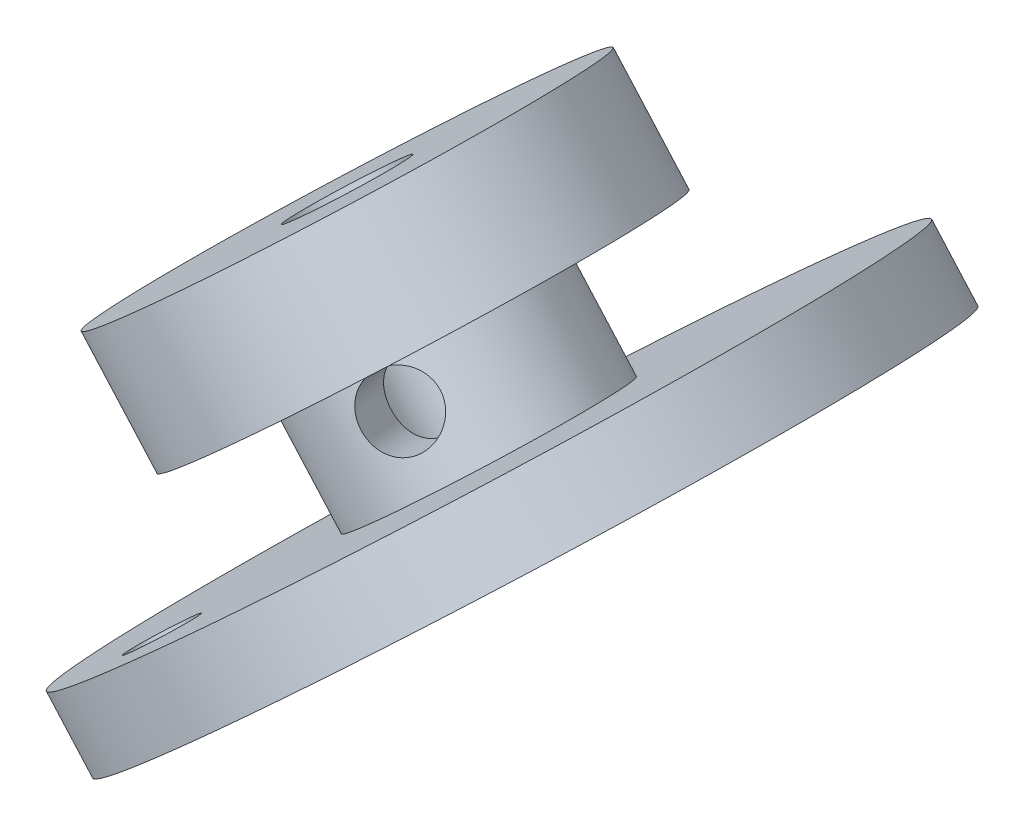
ISO-10303-21;
HEADER;
FILE_DESCRIPTION(('STEP AP214'),'2;1');
FILE_NAME('part.step','',(''),(''),'','','');
FILE_SCHEMA(('AUTOMOTIVE_DESIGN { 1 0 10303 214 1 1 1 1 }'));
ENDSEC;
DATA;
#1=APPLICATION_CONTEXT('core data for automotive mechanical design processes');
#2=APPLICATION_PROTOCOL_DEFINITION('international standard','automotive_design',2000,#1);
#3=PRODUCT_CONTEXT('',#1,'mechanical');
#4=PRODUCT('Part','Part','',(#3));
#5=PRODUCT_RELATED_PRODUCT_CATEGORY('part','',(#4));
#6=PRODUCT_DEFINITION_FORMATION('','',#4);
#7=PRODUCT_DEFINITION_CONTEXT('part definition',#1,'design');
#8=PRODUCT_DEFINITION('design','',#6,#7);
#9=PRODUCT_DEFINITION_SHAPE('','',#8);
#10=(LENGTH_UNIT() NAMED_UNIT(*) SI_UNIT(.MILLI.,.METRE.));
#11=(NAMED_UNIT(*) PLANE_ANGLE_UNIT() SI_UNIT($,.RADIAN.));
#12=(NAMED_UNIT(*) SI_UNIT($,.STERADIAN.) SOLID_ANGLE_UNIT());
#13=UNCERTAINTY_MEASURE_WITH_UNIT(LENGTH_MEASURE(1.E-05),#10,'distance_accuracy_value','');
#14=(GEOMETRIC_REPRESENTATION_CONTEXT(3) GLOBAL_UNCERTAINTY_ASSIGNED_CONTEXT((#13)) GLOBAL_UNIT_ASSIGNED_CONTEXT((#10,
#11,#12)) REPRESENTATION_CONTEXT('',''));
#15=CARTESIAN_POINT('',(0.,0.,0.));
#16=DIRECTION('',(0.,0.,1.));
#17=DIRECTION('',(1.,0.,0.));
#18=AXIS2_PLACEMENT_3D('',#15,#16,#17);
#19=CARTESIAN_POINT('',(70.9222588106821,-8.83401766160135,-35.8149463121795));
#20=DIRECTION('',(-0.664699798962186,0.747110552234159,0.));
#21=DIRECTION('',(-0.747110552234159,-0.664699798962186,0.));
#22=AXIS2_PLACEMENT_3D('',#19,#20,#21);
#23=PLANE('',#22);
#24=CARTESIAN_POINT('',(72.9575706573762,-7.02321285998626,-42.3844999999999));
#25=DIRECTION('',(-0.664699798962186,0.747110552234159,0.));
#26=DIRECTION('',(-0.747110552234159,-0.664699798962186,0.));
#27=AXIS2_PLACEMENT_3D('',#24,#25,#26);
#28=CIRCLE('',#27,7.112);
#29=CARTESIAN_POINT('',(67.6441204098869,-11.7505578302053,-42.3844999999999));
#30=VERTEX_POINT('',#29);
#31=EDGE_CURVE('E17',#30,#30,#28,.F.);
#32=ORIENTED_EDGE('',*,*,#31,.F.);
#33=EDGE_LOOP('',(#32));
#34=FACE_BOUND('',#33,.T.);
#35=CARTESIAN_POINT('',(72.9575706573762,-7.02321285998626,-42.3844999999999));
#36=DIRECTION('',(-0.664699798962186,0.747110552234159,0.));
#37=DIRECTION('',(-0.747110552234159,-0.664699798962186,0.));
#38=AXIS2_PLACEMENT_3D('',#35,#36,#37);
#39=CIRCLE('',#38,12.827);
#40=CARTESIAN_POINT('',(63.3743836038686,-15.5493171812742,-42.3844999999999));
#41=VERTEX_POINT('',#40);
#42=EDGE_CURVE('E113',#41,#41,#39,.T.);
#43=ORIENTED_EDGE('',*,*,#42,.F.);
#44=EDGE_LOOP('',(#43));
#45=FACE_BOUND('',#44,.T.);
#46=ADVANCED_FACE('F14',(#34,#45),#23,.F.);
#47=CARTESIAN_POINT('',(68.3990594360934,-1.8995286927643,-42.3844999999999));
#48=DIRECTION('',(-0.664699798962186,0.747110552234159,0.));
#49=DIRECTION('',(-0.747110552234159,-0.664699798962186,0.));
#50=AXIS2_PLACEMENT_3D('',#47,#48,#49);
#51=CYLINDRICAL_SURFACE('',#50,7.112);
#52=ORIENTED_EDGE('',*,*,#31,.T.);
#53=EDGE_LOOP('',(#52));
#54=FACE_BOUND('',#53,.T.);
#55=CARTESIAN_POINT('',(76.0241172948497,-7.24780935635152,-35.6026560288344));
#56=CARTESIAN_POINT('',(75.9504708586883,-7.16502094183076,-35.602655761772));
#57=CARTESIAN_POINT('',(75.8835464759126,-7.07608454668511,-35.6055164268872));
#58=CARTESIAN_POINT('',(75.7650808582406,-6.88870017845056,-35.6170619082306));
#59=CARTESIAN_POINT('',(75.7135679107307,-6.79023514868241,-35.6257573403765));
#60=CARTESIAN_POINT('',(75.6271418746926,-6.58720022980893,-35.6492225800623));
#61=CARTESIAN_POINT('',(75.5921944558109,-6.48264347495349,-35.6639797057673));
#62=CARTESIAN_POINT('',(75.5390834669348,-6.27047138684827,-35.6999452632156));
#63=CARTESIAN_POINT('',(75.5209167433758,-6.16285663220252,-35.7211524818089));
#64=CARTESIAN_POINT('',(75.5009165804455,-5.9449053893381,-35.7710837477244));
#65=CARTESIAN_POINT('',(75.4995162196565,-5.83457024549286,-35.7999874593855));
#66=CARTESIAN_POINT('',(75.5136103358346,-5.61727533426086,-35.8654278420963));
#67=CARTESIAN_POINT('',(75.5291076839662,-5.51031614367509,-35.9019658094632));
#68=CARTESIAN_POINT('',(75.5765804979763,-5.30115959009438,-35.9835878763024));
#69=CARTESIAN_POINT('',(75.6088526306614,-5.19908535565039,-36.0288162729473));
#70=CARTESIAN_POINT('',(75.6888041411077,-5.00526764287189,-36.1271167197071));
#71=CARTESIAN_POINT('',(75.7364804513616,-4.91352211263415,-36.1801872070484));
#72=CARTESIAN_POINT('',(75.8442044210536,-4.74572191112271,-36.2918719827349));
#73=CARTESIAN_POINT('',(75.9039012832889,-4.66932357300294,-36.3503079815506));
#74=CARTESIAN_POINT('',(76.0345009094757,-4.53184728491261,-36.4724269037569));
#75=CARTESIAN_POINT('',(76.1054015650998,-4.47076645807934,-36.5361088388913));
#76=CARTESIAN_POINT('',(76.2541055422014,-4.36724603751666,-36.6648890647425));
#77=CARTESIAN_POINT('',(76.3316538739802,-4.32432384760556,-36.7298949524714));
#78=CARTESIAN_POINT('',(76.4932529188901,-4.25558444597134,-36.8608489648041));
#79=CARTESIAN_POINT('',(76.5773040612665,-4.22976836448655,-36.9267971513737));
#80=CARTESIAN_POINT('',(76.7508461841944,-4.19530951116481,-37.0579824556892));
#81=CARTESIAN_POINT('',(76.8403863668788,-4.18685647491406,-37.1232040505097));
#82=CARTESIAN_POINT('',(77.0221599912275,-4.18735961270125,-37.2497042755367));
#83=CARTESIAN_POINT('',(77.1143938507755,-4.19631850222233,-37.3109822891809));
#84=CARTESIAN_POINT('',(77.3029834776518,-4.23149767946023,-37.4291257946613));
#85=CARTESIAN_POINT('',(77.3993716478251,-4.25830298252526,-37.4857660350432));
#86=CARTESIAN_POINT('',(77.5912577663531,-4.32857803413807,-37.5895461336241));
#87=CARTESIAN_POINT('',(77.6867552904918,-4.37205534601962,-37.6366816651381));
#88=CARTESIAN_POINT('',(77.8756015694483,-4.47456330875114,-37.7193199619949));
#89=CARTESIAN_POINT('',(77.9689250340678,-4.53372351596034,-37.7547200283801));
#90=CARTESIAN_POINT('',(78.1501707614734,-4.6653824729675,-37.8111596007553));
#91=CARTESIAN_POINT('',(78.2381040526075,-4.73785268667696,-37.8322293841767));
#92=CARTESIAN_POINT('',(78.3573848929284,-4.84844285934239,-37.8510605013324));
#93=CARTESIAN_POINT('',(78.3919883261081,-4.88212550291915,-37.8552532798523));
#94=CARTESIAN_POINT('',(78.4596537301621,-4.95122710567418,-37.8608543803664));
#95=CARTESIAN_POINT('',(78.4927156939058,-4.98664607288265,-37.8622626894816));
#96=CARTESIAN_POINT('',(78.5985776991265,-5.10563851032189,-37.8622526638012));
#97=CARTESIAN_POINT('',(78.6677839680349,-5.19254472499541,-37.8548674765179));
#98=CARTESIAN_POINT('',(78.7951108646418,-5.3720452662529,-37.8257518577326));
#99=CARTESIAN_POINT('',(78.8532110376251,-5.46464968083525,-37.8039952796981));
#100=CARTESIAN_POINT('',(78.956301639674,-5.65285823479654,-37.7474875506186));
#101=CARTESIAN_POINT('',(79.001319105678,-5.74845572883352,-37.7127635427868));
#102=CARTESIAN_POINT('',(79.076916282136,-5.94062199006293,-37.6322123889181));
#103=CARTESIAN_POINT('',(79.1074987048121,-6.03719057131109,-37.5863873311246));
#104=CARTESIAN_POINT('',(79.1536758536644,-6.23185230604615,-37.4845523565181));
#105=CARTESIAN_POINT('',(79.1688639361842,-6.32992059616388,-37.4283103602143));
#106=CARTESIAN_POINT('',(79.1819109351952,-6.52306821921233,-37.3090545940014));
#107=CARTESIAN_POINT('',(79.1797669063137,-6.61814704136475,-37.2460396749151));
#108=CARTESIAN_POINT('',(79.1573569507689,-6.80500531936435,-37.1147229904977));
#109=CARTESIAN_POINT('',(79.1367597630576,-6.89669242495068,-37.0463455214305));
#110=CARTESIAN_POINT('',(79.0768954207796,-7.07263870410643,-36.9082162522028));
#111=CARTESIAN_POINT('',(79.0376319825789,-7.15689935229322,-36.838464728259));
#112=CARTESIAN_POINT('',(78.9423371634163,-7.313641412766,-36.7021354419221));
#113=CARTESIAN_POINT('',(78.8867643800688,-7.38637058251518,-36.6355222224803));
#114=CARTESIAN_POINT('',(78.7599299321514,-7.52049701397289,-36.5059377075336));
#115=CARTESIAN_POINT('',(78.6886712183671,-7.58189640301426,-36.4429657298597));
#116=CARTESIAN_POINT('',(78.5348860817536,-7.68993750086617,-36.3242604234014));
#117=CARTESIAN_POINT('',(78.4527396134303,-7.73695062541556,-36.2683717174764));
#118=CARTESIAN_POINT('',(78.2782455386014,-7.81716265820082,-36.16298596111));
#119=CARTESIAN_POINT('',(78.1858972585099,-7.85036065358672,-36.1134893331812));
#120=CARTESIAN_POINT('',(77.9928151411813,-7.90220412329633,-36.0210479155844));
#121=CARTESIAN_POINT('',(77.8920010604384,-7.92068747935797,-35.9781801976535));
#122=CARTESIAN_POINT('',(77.6859401809463,-7.94179256750591,-35.899836724501));
#123=CARTESIAN_POINT('',(77.580692693288,-7.94441182523883,-35.864362123231));
#124=CARTESIAN_POINT('',(77.3652069340472,-7.93316197642772,-35.7995482494859));
#125=CARTESIAN_POINT('',(77.2549217731452,-7.9187207430656,-35.7704629522367));
#126=CARTESIAN_POINT('',(77.0363323056915,-7.8722035016048,-35.7196302345286));
#127=CARTESIAN_POINT('',(76.9280289215796,-7.84011948690568,-35.6978861528769));
#128=CARTESIAN_POINT('',(76.7160447644558,-7.75819715627407,-35.6611256240605));
#129=CARTESIAN_POINT('',(76.6124113243356,-7.70820967272959,-35.6461681696168));
#130=CARTESIAN_POINT('',(76.4144616306718,-7.59141213479965,-35.6228492094173));
#131=CARTESIAN_POINT('',(76.3201260953699,-7.52463795951241,-35.6144737910859));
#132=CARTESIAN_POINT('',(76.1950969543534,-7.41916201566514,-35.6070404003779));
#133=CARTESIAN_POINT('',(76.159208453603,-7.38662268903548,-35.6053956529044));
#134=CARTESIAN_POINT('',(76.0898237778856,-7.31905071201701,-35.6032035229966));
#135=CARTESIAN_POINT('',(76.0563276139846,-7.28401805009661,-35.602656145638));
#136=CARTESIAN_POINT('',(76.0241172948497,-7.24780935635152,-35.6026560288344));
#137=B_SPLINE_CURVE_WITH_KNOTS('',3,(#55,#56,#57,#58,#59,#60,#61,#62,#63,#64,#65,#66,#67,#68,
#69,#70,#71,#72,#73,#74,#75,#76,#77,#78,#79,#80,#81,#82,#83,#84,#85,#86,#87,#88,#89,#90,#91,#92,
#93,#94,#95,#96,#97,#98,#99,#100,#101,#102,#103,#104,#105,#106,#107,#108,#109,#110,#111,#112,
#113,#114,#115,#116,#117,#118,#119,#120,#121,#122,#123,#124,#125,#126,#127,#128,#129,#130,#131,
#132,#133,#134,#135,#136),.UNSPECIFIED.,.T.,.F.,(4,2,2,2,2,2,2,2,2,2,2,2,2,2,2,2,2,2,2,2,2,2,2,
2,2,2,2,2,2,2,2,2,2,2,2,2,2,2,2,2,4),(0.,0.332227667044804,0.665061442126181,0.997202404728973,
1.32928093599779,1.66991915884053,2.01061527005121,2.35755269732793,2.70442107984189,
3.04234303810744,3.38020148185171,3.70841014031842,4.03664048209371,4.3684388979744,
4.70028906374852,5.04359125905306,5.3870493795839,5.73343835328494,6.07909317382578,
6.22439700987266,6.36970151798854,6.70192918503333,7.03476296011471,7.36690392271749,
7.6989824539863,8.03962067682904,8.38031678803971,8.72725421531644,9.0741225978304,
9.41204455609595,9.74990299984023,10.078111658307,10.4063420000823,10.7381404159629,
11.069990581737,11.4132927770416,11.7567508975724,12.1031398712734,12.4487946918143,
12.5940985278616,12.739403035978),.UNSPECIFIED.);
#138=CARTESIAN_POINT('',(76.0241172948497,-7.24780935635152,-35.6026560288344));
#139=VERTEX_POINT('',#138);
#140=EDGE_CURVE('E89',#139,#139,#137,.T.);
#141=ORIENTED_EDGE('',*,*,#140,.T.);
#142=EDGE_LOOP('',(#141));
#143=FACE_BOUND('',#142,.T.);
#144=CARTESIAN_POINT('',(76.9251637573815,-11.482715746272,-42.3844999999999));
#145=DIRECTION('',(-0.664699798962186,0.747110552234159,0.));
#146=DIRECTION('',(-0.747110552234159,-0.664699798962186,0.));
#147=AXIS2_PLACEMENT_3D('',#144,#145,#146);
#148=CIRCLE('',#147,7.112);
#149=CARTESIAN_POINT('',(71.6117135098922,-16.2100607164911,-42.3844999999999));
#150=VERTEX_POINT('',#149);
#151=EDGE_CURVE('E96',#150,#150,#148,.T.);
#152=ORIENTED_EDGE('',*,*,#151,.T.);
#153=EDGE_LOOP('',(#152));
#154=FACE_BOUND('',#153,.T.);
#155=ADVANCED_FACE('F97',(#54,#143,#154),#51,.T.);
#156=CARTESIAN_POINT('',(68.3990594360934,-1.8995286927643,-42.3844999999999));
#157=DIRECTION('',(-0.664699798962186,0.747110552234159,0.));
#158=DIRECTION('',(-0.747110552234159,-0.664699798962186,0.));
#159=AXIS2_PLACEMENT_3D('',#156,#157,#158);
#160=CYLINDRICAL_SURFACE('',#159,12.827);
#161=CARTESIAN_POINT('',(68.3990594360936,-1.89952869276451,-42.3844999999999));
#162=DIRECTION('',(-0.664699798962186,0.747110552234159,0.));
#163=DIRECTION('',(-0.747110552234159,-0.664699798962186,0.));
#164=AXIS2_PLACEMENT_3D('',#161,#162,#163);
#165=CIRCLE('',#164,12.827);
#166=CARTESIAN_POINT('',(58.8158723825861,-10.4256330140525,-42.3844999999999));
#167=VERTEX_POINT('',#166);
#168=EDGE_CURVE('E86',#167,#167,#165,.F.);
#169=ORIENTED_EDGE('',*,*,#168,.T.);
#170=EDGE_LOOP('',(#169));
#171=FACE_BOUND('',#170,.T.);
#172=ORIENTED_EDGE('',*,*,#42,.T.);
#173=EDGE_LOOP('',(#172));
#174=FACE_BOUND('',#173,.T.);
#175=ADVANCED_FACE('F101',(#171,#174),#160,.T.);
#176=CARTESIAN_POINT('',(70.8192282172992,-16.9151301511175,-22.6758389365389));
#177=DIRECTION('',(0.664699798962186,-0.747110552234159,0.));
#178=DIRECTION('',(0.747110552234159,0.664699798962186,0.));
#179=AXIS2_PLACEMENT_3D('',#176,#177,#178);
#180=PLANE('',#179);
#181=ORIENTED_EDGE('',*,*,#151,.F.);
#182=EDGE_LOOP('',(#181));
#183=FACE_BOUND('',#182,.T.);
#184=CARTESIAN_POINT('',(72.2730223935094,-15.6216981499637,-27.368377284982));
#185=DIRECTION('',(-0.664699798962186,0.747110552234159,0.));
#186=DIRECTION('',(-0.747110552234159,-0.664699798962186,0.));
#187=AXIS2_PLACEMENT_3D('',#184,#185,#186);
#188=CIRCLE('',#187,1.905);
#189=CARTESIAN_POINT('',(70.8497767915033,-16.8879512669866,-27.368377284982));
#190=VERTEX_POINT('',#189);
#191=EDGE_CURVE('E41',#190,#190,#188,.F.);
#192=ORIENTED_EDGE('',*,*,#191,.T.);
#193=EDGE_LOOP('',(#192));
#194=FACE_BOUND('',#193,.T.);
#195=CARTESIAN_POINT('',(76.9251637573815,-11.482715746272,-42.3844999999999));
#196=DIRECTION('',(-0.664699798962185,0.747110552234159,0.));
#197=DIRECTION('',(-0.747110552234159,-0.664699798962185,0.));
#198=AXIS2_PLACEMENT_3D('',#195,#196,#197);
#199=CIRCLE('',#198,21.336);
#200=CARTESIAN_POINT('',(60.9848130149135,-25.6647506569292,-42.3844999999999));
#201=VERTEX_POINT('',#200);
#202=EDGE_CURVE('E84',#201,#201,#199,.F.);
#203=ORIENTED_EDGE('',*,*,#202,.F.);
#204=EDGE_LOOP('',(#203));
#205=FACE_BOUND('',#204,.T.);
#206=ADVANCED_FACE('F68',(#183,#194,#205),#180,.F.);
#207=CARTESIAN_POINT('',(77.3968702241981,-6.02647926881111,-36.4898667612435));
#208=DIRECTION('',(0.418009632275076,0.37190067481528,0.828829195550685));
#209=DIRECTION('',(0.892872695969098,0.,-0.450309170229603));
#210=AXIS2_PLACEMENT_3D('',#207,#208,#209);
#211=CYLINDRICAL_SURFACE('',#210,2.0193);
#212=CARTESIAN_POINT('',(77.2844071876067,-7.47422662923737,-41.1683193993993));
#213=CARTESIAN_POINT('',(77.3326524652259,-7.56946963752706,-41.102581379712));
#214=CARTESIAN_POINT('',(77.3727193399558,-7.66394165079535,-41.0296225910241));
#215=CARTESIAN_POINT('',(77.4344621299075,-7.85141694130959,-40.8743612142622));
#216=CARTESIAN_POINT('',(77.4561040442718,-7.94441719370468,-40.7920416679564));
#217=CARTESIAN_POINT('',(77.4787249371517,-8.12878437893057,-40.6222363581434));
#218=CARTESIAN_POINT('',(77.4796474933948,-8.2201461750076,-40.5347371381691));
#219=CARTESIAN_POINT('',(77.4583559355074,-8.39960794216561,-40.3592508078017));
#220=CARTESIAN_POINT('',(77.4361752770536,-8.48771243907229,-40.271264585915));
#221=CARTESIAN_POINT('',(77.3699794194033,-8.65131839688389,-40.1065171808026));
#222=CARTESIAN_POINT('',(77.3278980852574,-8.72726130159182,-40.029426449655));
#223=CARTESIAN_POINT('',(77.2231193647374,-8.87170072986755,-39.8826586325297));
#224=CARTESIAN_POINT('',(77.1604439926317,-8.94020510136896,-39.812973734802));
#225=CARTESIAN_POINT('',(77.0269673959466,-9.05787021045445,-39.6934787022823));
#226=CARTESIAN_POINT('',(76.9586172143692,-9.10839616573109,-39.642251484116));
#227=CARTESIAN_POINT('',(76.8106749193975,-9.20050184346144,-39.548812322707));
#228=CARTESIAN_POINT('',(76.7310825429931,-9.24208135655663,-39.5066005904387));
#229=CARTESIAN_POINT('',(76.5643267389905,-9.31489039975643,-39.4319904578757));
#230=CARTESIAN_POINT('',(76.4772548384545,-9.34622734385775,-39.3994905413457));
#231=CARTESIAN_POINT('',(76.2974167619592,-9.39863818930176,-39.3432838563303));
#232=CARTESIAN_POINT('',(76.204649437935,-9.41971001373611,-39.3195788675252));
#233=CARTESIAN_POINT('',(76.0043415473207,-9.4531703238738,-39.2776798312612));
#234=CARTESIAN_POINT('',(75.8963667216639,-9.46420847660532,-39.2604924419031));
#235=CARTESIAN_POINT('',(75.678816665128,-9.47254248669661,-39.234285565974));
#236=CARTESIAN_POINT('',(75.5692394820082,-9.46981989298895,-39.2252770651381));
#237=CARTESIAN_POINT('',(75.3355238490008,-9.44841892856219,-39.2126097737195));
#238=CARTESIAN_POINT('',(75.2115290181908,-9.4275280824458,-39.2098931507534));
#239=CARTESIAN_POINT('',(74.9688526639319,-9.36487976398747,-39.2091872437042));
#240=CARTESIAN_POINT('',(74.8501656019232,-9.3231446233121,-39.2111929088911));
#241=CARTESIAN_POINT('',(74.6520993124425,-9.23023773538981,-39.2156526584976));
#242=CARTESIAN_POINT('',(74.5703550614756,-9.18409947949949,-39.2178661283991));
#243=CARTESIAN_POINT('',(74.4158866012366,-9.07883699662594,-39.2215075639144));
#244=CARTESIAN_POINT('',(74.3431320046429,-9.01975849994344,-39.2229382351409));
#245=CARTESIAN_POINT('',(74.249107952138,-8.92837979543183,-39.2238429047497));
#246=CARTESIAN_POINT('',(74.222919024554,-8.90100869063621,-39.2239743174725));
#247=CARTESIAN_POINT('',(74.1645571289583,-8.83540093697706,-39.2239717531226));
#248=CARTESIAN_POINT('',(74.133139380157,-8.79648294722896,-39.2237397727852));
#249=CARTESIAN_POINT('',(74.0741265157319,-8.71584355860212,-39.2228517601711));
#250=CARTESIAN_POINT('',(74.0465338386722,-8.67412039630388,-39.2221954588768));
#251=CARTESIAN_POINT('',(73.969590821713,-8.54518741660411,-39.2197422271598));
#252=CARTESIAN_POINT('',(73.9261998327895,-8.45435544304673,-39.2174616156437));
#253=CARTESIAN_POINT('',(73.8554612530412,-8.2677773384788,-39.2131624228209));
#254=CARTESIAN_POINT('',(73.8279714071878,-8.17208338495285,-39.2111416480175));
#255=CARTESIAN_POINT('',(73.787070424491,-7.97779426000278,-39.2091515970517));
#256=CARTESIAN_POINT('',(73.773657482131,-7.87919946231165,-39.2091820577633));
#257=CARTESIAN_POINT('',(73.7586050934677,-7.66735277484347,-39.2133201739361));
#258=CARTESIAN_POINT('',(73.7588715913032,-7.55397699147381,-39.2179966666038));
#259=CARTESIAN_POINT('',(73.7744733315773,-7.32872636149715,-39.2346787722722));
#260=CARTESIAN_POINT('',(73.7898227627948,-7.21685302872483,-39.2466912823651));
#261=CARTESIAN_POINT('',(73.8374506451463,-6.98341680047782,-39.2823122421834));
#262=CARTESIAN_POINT('',(73.8716258441529,-6.86241961703674,-39.307195910101));
#263=CARTESIAN_POINT('',(73.9566605683338,-6.63052297272073,-39.3714460737316));
#264=CARTESIAN_POINT('',(74.0075027728517,-6.51961318105027,-39.4107975393825));
#265=CARTESIAN_POINT('',(74.1180655906347,-6.32411098021435,-39.5002247752745));
#266=CARTESIAN_POINT('',(74.1763046081302,-6.23797979424725,-39.5487514953243));
#267=CARTESIAN_POINT('',(74.3027708984804,-6.08226379279585,-39.6577914914466));
#268=CARTESIAN_POINT('',(74.3709872821862,-6.01266115285565,-39.7182917249058));
#269=CARTESIAN_POINT('',(74.50466828443,-5.90133883826066,-39.8400220414283));
#270=CARTESIAN_POINT('',(74.5692010709433,-5.85709016718444,-39.899985735928));
#271=CARTESIAN_POINT('',(74.7017816276675,-5.7839917767428,-40.0251385089696));
#272=CARTESIAN_POINT('',(74.7698291939882,-5.75514116524355,-40.0903272845287));
#273=CARTESIAN_POINT('',(74.9078294129234,-5.71279089418549,-40.2236292045548));
#274=CARTESIAN_POINT('',(74.9777834304636,-5.69930254551227,-40.2917444654856));
#275=CARTESIAN_POINT('',(75.1184001612093,-5.6869425381906,-40.428601949359));
#276=CARTESIAN_POINT('',(75.1890634272021,-5.68808333675582,-40.4973446568188));
#277=CARTESIAN_POINT('',(75.3393584064535,-5.70492292118082,-40.6419470256355));
#278=CARTESIAN_POINT('',(75.4189833164826,-5.72246176193804,-40.7175948050141));
#279=CARTESIAN_POINT('',(75.5776861980799,-5.77311279893401,-40.8638847284636));
#280=CARTESIAN_POINT('',(75.6567647442142,-5.80620480680059,-40.9345332253403));
#281=CARTESIAN_POINT('',(75.7707002431309,-5.86416264828506,-41.0307894552103));
#282=CARTESIAN_POINT('',(75.8057613010346,-5.88341347132586,-41.05964808992));
#283=CARTESIAN_POINT('',(75.8758408980752,-5.92459213829654,-41.1154793459711));
#284=CARTESIAN_POINT('',(75.9108594154977,-5.94652101567676,-41.1424512328692));
#285=CARTESIAN_POINT('',(76.017071903272,-6.01694653651357,-41.2209272472745));
#286=CARTESIAN_POINT('',(76.0882422430528,-6.06947466750408,-41.2689702207543));
#287=CARTESIAN_POINT('',(76.2303836200097,-6.18398718032143,-41.3526603053167));
#288=CARTESIAN_POINT('',(76.3013546719444,-6.24597084203655,-41.3883083596909));
#289=CARTESIAN_POINT('',(76.4274718339042,-6.36379965893808,-41.4379570424605));
#290=CARTESIAN_POINT('',(76.4828018037127,-6.41818684493392,-41.4549360801202));
#291=CARTESIAN_POINT('',(76.5920264043142,-6.5305856397478,-41.4777474654281));
#292=CARTESIAN_POINT('',(76.6459219128424,-6.58859495594374,-41.483586791543));
#293=CARTESIAN_POINT('',(76.7649974321174,-6.72243199761852,-41.4835642387768));
#294=CARTESIAN_POINT('',(76.8294329205097,-6.79894507267319,-41.4742345400209));
#295=CARTESIAN_POINT('',(76.9518004179774,-6.9530822563191,-41.4381780273327));
#296=CARTESIAN_POINT('',(77.0097244547302,-7.03070759845767,-41.4114301536629));
#297=CARTESIAN_POINT('',(77.106047411608,-7.16959099619285,-41.3505870749774));
#298=CARTESIAN_POINT('',(77.1460165296036,-7.23094877767857,-41.3191142773619));
#299=CARTESIAN_POINT('',(77.2198897859036,-7.35304999165244,-41.2488357654183));
#300=CARTESIAN_POINT('',(77.2537948370368,-7.41379351530432,-41.2100311565649));
#301=CARTESIAN_POINT('',(77.2844071876067,-7.47422662923737,-41.1683193993993));
#302=B_SPLINE_CURVE_WITH_KNOTS('',3,(#212,#213,#214,#215,#216,#217,#218,#219,#220,#221,#222,
#223,#224,#225,#226,#227,#228,#229,#230,#231,#232,#233,#234,#235,#236,#237,#238,#239,#240,#241,
#242,#243,#244,#245,#246,#247,#248,#249,#250,#251,#252,#253,#254,#255,#256,#257,#258,#259,#260,
#261,#262,#263,#264,#265,#266,#267,#268,#269,#270,#271,#272,#273,#274,#275,#276,#277,#278,#279,
#280,#281,#282,#283,#284,#285,#286,#287,#288,#289,#290,#291,#292,#293,#294,#295,#296,#297,#298,
#299,#300,#301),.UNSPECIFIED.,.T.,.F.,(4,2,2,2,2,2,2,2,2,2,2,2,2,2,2,2,2,2,2,2,2,2,2,2,2,2,2,2,
2,2,2,2,2,2,2,2,2,2,2,2,2,2,2,2,4),(0.,0.375847290915491,0.752386664755367,1.12995129423357,
1.50696993293525,1.85315757517248,2.19897635296868,2.49524491423698,2.79152040782611,
3.08458095087396,3.37770076330862,3.70609938350857,4.03493845301696,4.41050848297632,
4.7856770039701,5.06624005641867,5.34582716334997,5.45940147083491,5.6091966256611,
5.75908684315757,6.05942310449441,6.35702919394225,6.65459710749378,6.99372411071799,
7.33317044234886,7.71557891315556,8.09759123128142,8.43971083509854,8.78145980295161,
9.07578333990228,9.37008982246409,9.66461285641229,9.95938670332735,10.2917949730132,
10.6237729556634,10.7716503033979,10.9195848977985,11.2204380962132,11.5212683937606,
11.7587194770871,11.9960217603925,12.2955176494992,12.5953763231636,12.8338929876282,
13.0723737177227),.UNSPECIFIED.);
#303=CARTESIAN_POINT('',(77.2844071876067,-7.47422662923737,-41.1683193993993));
#304=VERTEX_POINT('',#303);
#305=EDGE_CURVE('E34',#304,#304,#302,.T.);
#306=ORIENTED_EDGE('',*,*,#305,.T.);
#307=EDGE_LOOP('',(#306));
#308=FACE_BOUND('',#307,.T.);
#309=ORIENTED_EDGE('',*,*,#140,.F.);
#310=EDGE_LOOP('',(#309));
#311=FACE_BOUND('',#310,.T.);
#312=ADVANCED_FACE('F43',(#308,#311),#211,.F.);
#313=CARTESIAN_POINT('',(64.7282291411632,-5.16544449567732,-30.535840670181));
#314=DIRECTION('',(0.664699798962186,-0.747110552234159,0.));
#315=DIRECTION('',(0.747110552234159,0.664699798962186,0.));
#316=AXIS2_PLACEMENT_3D('',#313,#314,#315);
#317=PLANE('',#316);
#318=CARTESIAN_POINT('',(68.3990594360935,-1.89952869276435,-42.3844999999999));
#319=DIRECTION('',(-0.664699798962185,0.747110552234159,0.));
#320=DIRECTION('',(-0.747110552234159,-0.664699798962185,0.));
#321=AXIS2_PLACEMENT_3D('',#318,#319,#320);
#322=CIRCLE('',#321,3.175);
#323=CARTESIAN_POINT('',(66.02698343275,-4.00995055446928,-42.3844999999999));
#324=VERTEX_POINT('',#323);
#325=EDGE_CURVE('E31',#324,#324,#322,.F.);
#326=ORIENTED_EDGE('',*,*,#325,.T.);
#327=EDGE_LOOP('',(#326));
#328=FACE_BOUND('',#327,.T.);
#329=ORIENTED_EDGE('',*,*,#168,.F.);
#330=EDGE_LOOP('',(#329));
#331=FACE_BOUND('',#330,.T.);
#332=ADVANCED_FACE('F60',(#328,#331),#317,.F.);
#333=CARTESIAN_POINT('',(68.3990594360934,-1.8995286927643,-42.3844999999999));
#334=DIRECTION('',(-0.664699798962185,0.747110552234159,0.));
#335=DIRECTION('',(-0.747110552234159,-0.664699798962185,0.));
#336=AXIS2_PLACEMENT_3D('',#333,#334,#335);
#337=CYLINDRICAL_SURFACE('',#336,21.336);
#338=ORIENTED_EDGE('',*,*,#202,.T.);
#339=EDGE_LOOP('',(#338));
#340=FACE_BOUND('',#339,.T.);
#341=CARTESIAN_POINT('',(79.7109206148321,-14.6138560706854,-42.3844999999999));
#342=DIRECTION('',(-0.664699798962185,0.747110552234159,0.));
#343=DIRECTION('',(-0.747110552234159,-0.664699798962185,0.));
#344=AXIS2_PLACEMENT_3D('',#341,#342,#343);
#345=CIRCLE('',#344,21.336);
#346=CARTESIAN_POINT('',(63.770569872364,-28.7958909813426,-42.3844999999999));
#347=VERTEX_POINT('',#346);
#348=EDGE_CURVE('E26',#347,#347,#345,.T.);
#349=ORIENTED_EDGE('',*,*,#348,.T.);
#350=EDGE_LOOP('',(#349));
#351=FACE_BOUND('',#350,.T.);
#352=ADVANCED_FACE('F57',(#340,#351),#337,.T.);
#353=CARTESIAN_POINT('',(75.0587792509599,-18.752838474377,-27.368377284982));
#354=DIRECTION('',(-0.664699798962186,0.747110552234159,0.));
#355=DIRECTION('',(-0.747110552234159,-0.664699798962186,0.));
#356=AXIS2_PLACEMENT_3D('',#353,#354,#355);
#357=CYLINDRICAL_SURFACE('',#356,1.905);
#358=CARTESIAN_POINT('',(75.0587792509598,-18.7528384743769,-27.368377284982));
#359=DIRECTION('',(-0.664699798962186,0.747110552234159,0.));
#360=DIRECTION('',(-0.747110552234159,-0.664699798962186,0.));
#361=AXIS2_PLACEMENT_3D('',#358,#359,#360);
#362=CIRCLE('',#361,1.905);
#363=CARTESIAN_POINT('',(73.6355336489538,-20.0190915913999,-27.368377284982));
#364=VERTEX_POINT('',#363);
#365=EDGE_CURVE('E21',#364,#364,#362,.F.);
#366=ORIENTED_EDGE('',*,*,#365,.T.);
#367=EDGE_LOOP('',(#366));
#368=FACE_BOUND('',#367,.T.);
#369=ORIENTED_EDGE('',*,*,#191,.F.);
#370=EDGE_LOOP('',(#369));
#371=FACE_BOUND('',#370,.T.);
#372=ADVANCED_FACE('F53',(#368,#371),#357,.F.);
#373=CARTESIAN_POINT('',(68.3990594360934,-1.8995286927643,-42.3844999999999));
#374=DIRECTION('',(-0.664699798962185,0.747110552234159,0.));
#375=DIRECTION('',(-0.747110552234159,-0.664699798962185,0.));
#376=AXIS2_PLACEMENT_3D('',#373,#374,#375);
#377=CYLINDRICAL_SURFACE('',#376,3.175);
#378=ORIENTED_EDGE('',*,*,#325,.F.);
#379=EDGE_LOOP('',(#378));
#380=FACE_BOUND('',#379,.T.);
#381=CARTESIAN_POINT('',(79.710920614832,-14.6138560706854,-42.3844999999999));
#382=DIRECTION('',(-0.664699798962185,0.747110552234159,0.));
#383=DIRECTION('',(-0.747110552234159,-0.664699798962185,0.));
#384=AXIS2_PLACEMENT_3D('',#381,#382,#383);
#385=CIRCLE('',#384,3.175);
#386=CARTESIAN_POINT('',(77.3388446114886,-16.7242779323903,-42.3844999999999));
#387=VERTEX_POINT('',#386);
#388=EDGE_CURVE('E10',#387,#387,#385,.F.);
#389=ORIENTED_EDGE('',*,*,#388,.T.);
#390=EDGE_LOOP('',(#389));
#391=FACE_BOUND('',#390,.T.);
#392=ORIENTED_EDGE('',*,*,#305,.F.);
#393=EDGE_LOOP('',(#392));
#394=FACE_BOUND('',#393,.T.);
#395=ADVANCED_FACE('F47',(#380,#391,#394),#377,.F.);
#396=CARTESIAN_POINT('',(78.8022992547007,-15.4222510714062,-39.451663532223));
#397=DIRECTION('',(-0.664699798962186,0.747110552234159,0.));
#398=DIRECTION('',(-0.747110552234159,-0.664699798962186,0.));
#399=AXIS2_PLACEMENT_3D('',#396,#397,#398);
#400=PLANE('',#399);
#401=ORIENTED_EDGE('',*,*,#388,.F.);
#402=EDGE_LOOP('',(#401));
#403=FACE_BOUND('',#402,.T.);
#404=ORIENTED_EDGE('',*,*,#365,.F.);
#405=EDGE_LOOP('',(#404));
#406=FACE_BOUND('',#405,.T.);
#407=ORIENTED_EDGE('',*,*,#348,.F.);
#408=EDGE_LOOP('',(#407));
#409=FACE_BOUND('',#408,.T.);
#410=ADVANCED_FACE('F52',(#403,#406,#409),#400,.F.);
#411=CLOSED_SHELL('',(#46,#155,#175,#206,#312,#332,#352,#372,#395,#410));
#412=MANIFOLD_SOLID_BREP('B1',#411);
#413=ADVANCED_BREP_SHAPE_REPRESENTATION('',(#18,#412),#14);
#414=SHAPE_DEFINITION_REPRESENTATION(#9,#413);
ENDSEC;
END-ISO-10303-21;
